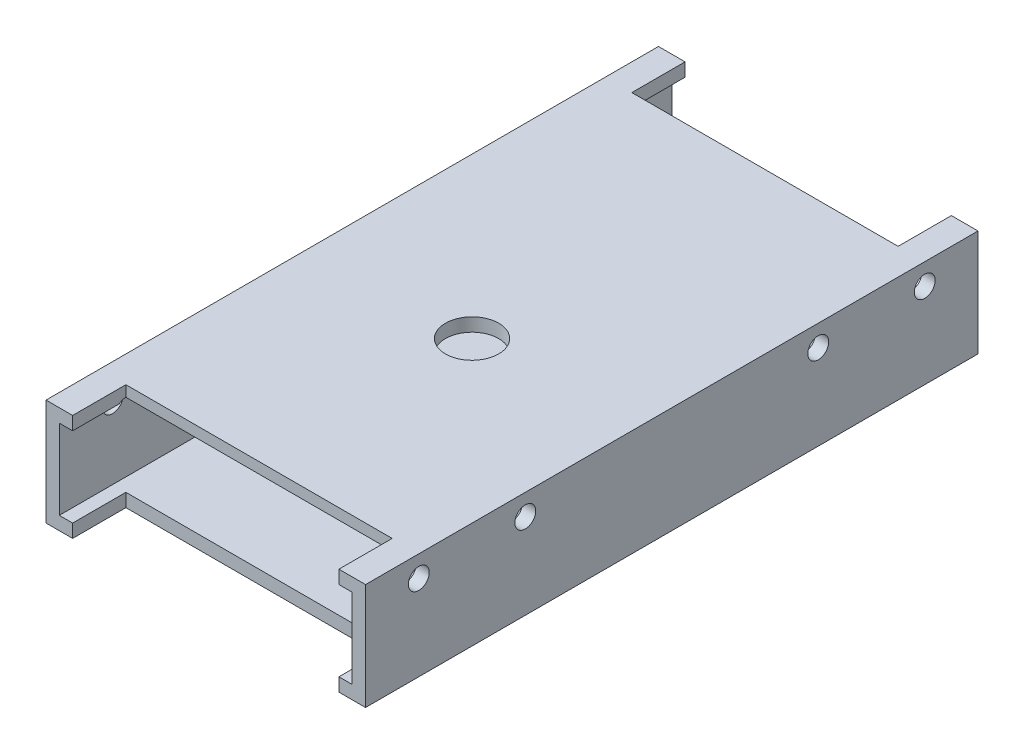
ISO-10303-21;
HEADER;
FILE_DESCRIPTION(('STEP AP214'),'2;1');
FILE_NAME('part.step','',(''),(''),'','','');
FILE_SCHEMA(('AUTOMOTIVE_DESIGN { 1 0 10303 214 1 1 1 1 }'));
ENDSEC;
DATA;
#1=APPLICATION_CONTEXT('core data for automotive mechanical design processes');
#2=APPLICATION_PROTOCOL_DEFINITION('international standard','automotive_design',2000,#1);
#3=PRODUCT_CONTEXT('',#1,'mechanical');
#4=PRODUCT('Part','Part','',(#3));
#5=PRODUCT_RELATED_PRODUCT_CATEGORY('part','',(#4));
#6=PRODUCT_DEFINITION_FORMATION('','',#4);
#7=PRODUCT_DEFINITION_CONTEXT('part definition',#1,'design');
#8=PRODUCT_DEFINITION('design','',#6,#7);
#9=PRODUCT_DEFINITION_SHAPE('','',#8);
#10=(LENGTH_UNIT() NAMED_UNIT(*) SI_UNIT(.MILLI.,.METRE.));
#11=(NAMED_UNIT(*) PLANE_ANGLE_UNIT() SI_UNIT($,.RADIAN.));
#12=(NAMED_UNIT(*) SI_UNIT($,.STERADIAN.) SOLID_ANGLE_UNIT());
#13=UNCERTAINTY_MEASURE_WITH_UNIT(LENGTH_MEASURE(1.E-05),#10,'distance_accuracy_value','');
#14=(GEOMETRIC_REPRESENTATION_CONTEXT(3) GLOBAL_UNCERTAINTY_ASSIGNED_CONTEXT((#13)) GLOBAL_UNIT_ASSIGNED_CONTEXT((#10,
#11,#12)) REPRESENTATION_CONTEXT('',''));
#15=CARTESIAN_POINT('',(0.,0.,0.));
#16=DIRECTION('',(0.,0.,1.));
#17=DIRECTION('',(1.,0.,0.));
#18=AXIS2_PLACEMENT_3D('',#15,#16,#17);
#19=CARTESIAN_POINT('',(0.,9.525,73.025));
#20=DIRECTION('',(0.,-1.,0.));
#21=DIRECTION('',(0.,0.,-1.));
#22=AXIS2_PLACEMENT_3D('',#19,#20,#21);
#23=PLANE('',#22);
#24=DIRECTION('',(1.,0.,0.));
#25=VECTOR('',#24,1.);
#26=CARTESIAN_POINT('',(-38.1,9.525,58.7227853951483));
#27=LINE('',#26,#25);
#28=CARTESIAN_POINT('',(-34.925,9.525,58.7227853951483));
#29=VERTEX_POINT('',#28);
#30=CARTESIAN_POINT('',(34.925,9.525,58.7227853951483));
#31=VERTEX_POINT('',#30);
#32=EDGE_CURVE('E657',#29,#31,#27,.T.);
#33=ORIENTED_EDGE('',*,*,#32,.F.);
#34=DIRECTION('',(0.,0.,-1.));
#35=VECTOR('',#34,1.);
#36=CARTESIAN_POINT('',(-34.925,9.525,73.025));
#37=LINE('',#36,#35);
#38=CARTESIAN_POINT('',(-34.925,9.525,36.5272146048516));
#39=VERTEX_POINT('',#38);
#40=EDGE_CURVE('E428',#29,#39,#37,.T.);
#41=ORIENTED_EDGE('',*,*,#40,.T.);
#42=DIRECTION('',(1.,0.,0.));
#43=VECTOR('',#42,1.);
#44=CARTESIAN_POINT('',(-38.1,9.525,36.5272146048516));
#45=LINE('',#44,#43);
#46=CARTESIAN_POINT('',(34.925,9.525,36.5272146048516));
#47=VERTEX_POINT('',#46);
#48=EDGE_CURVE('E85',#47,#39,#45,.F.);
#49=ORIENTED_EDGE('',*,*,#48,.F.);
#50=DIRECTION('',(0.,0.,-1.));
#51=VECTOR('',#50,1.);
#52=CARTESIAN_POINT('',(34.925,9.525,73.025));
#53=LINE('',#52,#51);
#54=EDGE_CURVE('E434',#31,#47,#53,.T.);
#55=ORIENTED_EDGE('',*,*,#54,.F.);
#56=EDGE_LOOP('',(#33,#41,#49,#55));
#57=FACE_BOUND('',#56,.T.);
#58=ADVANCED_FACE('F61',(#57),#23,.T.);
#59=DIRECTION('',(1.,0.,0.));
#60=VECTOR('',#59,1.);
#61=CARTESIAN_POINT('',(-38.1,9.525,61.9272146048516));
#62=LINE('',#61,#60);
#63=CARTESIAN_POINT('',(34.925,9.525,61.9272146048516));
#64=VERTEX_POINT('',#63);
#65=CARTESIAN_POINT('',(31.75,9.525,61.9272146048516));
#66=VERTEX_POINT('',#65);
#67=EDGE_CURVE('E667',#64,#66,#62,.F.);
#68=ORIENTED_EDGE('',*,*,#67,.F.);
#69=CARTESIAN_POINT('',(34.925,9.525,73.025));
#70=VERTEX_POINT('',#69);
#71=EDGE_CURVE('E429',#70,#64,#53,.T.);
#72=ORIENTED_EDGE('',*,*,#71,.F.);
#73=DIRECTION('',(-1.,0.,0.));
#74=VECTOR('',#73,1.);
#75=CARTESIAN_POINT('',(0.,9.525,73.025));
#76=LINE('',#75,#74);
#77=CARTESIAN_POINT('',(31.75,9.525,73.025));
#78=VERTEX_POINT('',#77);
#79=EDGE_CURVE('E386',#70,#78,#76,.T.);
#80=ORIENTED_EDGE('',*,*,#79,.T.);
#81=DIRECTION('',(0.,0.,-1.));
#82=VECTOR('',#81,1.);
#83=CARTESIAN_POINT('',(31.75,9.525,73.025));
#84=LINE('',#83,#82);
#85=EDGE_CURVE('E366',#78,#66,#84,.T.);
#86=ORIENTED_EDGE('',*,*,#85,.T.);
#87=EDGE_LOOP('',(#68,#72,#80,#86));
#88=FACE_BOUND('',#87,.T.);
#89=ADVANCED_FACE('F739',(#88),#23,.T.);
#90=DIRECTION('',(1.,0.,0.));
#91=VECTOR('',#90,1.);
#92=CARTESIAN_POINT('',(-38.1,9.525,-36.5272146048516));
#93=LINE('',#92,#91);
#94=CARTESIAN_POINT('',(-34.925,9.525,-36.5272146048516));
#95=VERTEX_POINT('',#94);
#96=CARTESIAN_POINT('',(34.925,9.525,-36.5272146048516));
#97=VERTEX_POINT('',#96);
#98=EDGE_CURVE('E637',#95,#97,#93,.T.);
#99=ORIENTED_EDGE('',*,*,#98,.F.);
#100=CARTESIAN_POINT('',(-34.925,9.525,-58.7227853951483));
#101=VERTEX_POINT('',#100);
#102=EDGE_CURVE('E530',#95,#101,#37,.T.);
#103=ORIENTED_EDGE('',*,*,#102,.T.);
#104=DIRECTION('',(1.,0.,0.));
#105=VECTOR('',#104,1.);
#106=CARTESIAN_POINT('',(-38.1,9.525,-58.7227853951483));
#107=LINE('',#106,#105);
#108=CARTESIAN_POINT('',(34.925,9.525,-58.7227853951483));
#109=VERTEX_POINT('',#108);
#110=EDGE_CURVE('E680',#109,#101,#107,.F.);
#111=ORIENTED_EDGE('',*,*,#110,.F.);
#112=EDGE_CURVE('E579',#97,#109,#53,.T.);
#113=ORIENTED_EDGE('',*,*,#112,.F.);
#114=EDGE_LOOP('',(#99,#103,#111,#113));
#115=FACE_BOUND('',#114,.T.);
#116=ADVANCED_FACE('F744',(#115),#23,.T.);
#117=DIRECTION('',(1.,0.,0.));
#118=VECTOR('',#117,1.);
#119=CARTESIAN_POINT('',(-38.1,9.525,-61.9272146048516));
#120=LINE('',#119,#118);
#121=CARTESIAN_POINT('',(-34.925,9.525,-61.9272146048516));
#122=VERTEX_POINT('',#121);
#123=CARTESIAN_POINT('',(-31.75,9.525,-61.9272146048516));
#124=VERTEX_POINT('',#123);
#125=EDGE_CURVE('E289',#122,#124,#120,.T.);
#126=ORIENTED_EDGE('',*,*,#125,.F.);
#127=CARTESIAN_POINT('',(-34.925,9.525,-73.025));
#128=VERTEX_POINT('',#127);
#129=EDGE_CURVE('E422',#122,#128,#37,.T.);
#130=ORIENTED_EDGE('',*,*,#129,.T.);
#131=DIRECTION('',(-1.,0.,0.));
#132=VECTOR('',#131,1.);
#133=CARTESIAN_POINT('',(0.,9.525,-73.025));
#134=LINE('',#133,#132);
#135=CARTESIAN_POINT('',(-31.75,9.525,-73.025));
#136=VERTEX_POINT('',#135);
#137=EDGE_CURVE('E403',#136,#128,#134,.T.);
#138=ORIENTED_EDGE('',*,*,#137,.F.);
#139=DIRECTION('',(0.,0.,-1.));
#140=VECTOR('',#139,1.);
#141=CARTESIAN_POINT('',(-31.75,9.525,73.025));
#142=LINE('',#141,#140);
#143=EDGE_CURVE('E373',#124,#136,#142,.T.);
#144=ORIENTED_EDGE('',*,*,#143,.F.);
#145=EDGE_LOOP('',(#126,#130,#138,#144));
#146=FACE_BOUND('',#145,.T.);
#147=ADVANCED_FACE('F542',(#146),#23,.T.);
#148=CARTESIAN_POINT('',(31.75,9.525,-61.9272146048516));
#149=VERTEX_POINT('',#148);
#150=CARTESIAN_POINT('',(34.925,9.525,-61.9272146048516));
#151=VERTEX_POINT('',#150);
#152=EDGE_CURVE('E679',#149,#151,#120,.T.);
#153=ORIENTED_EDGE('',*,*,#152,.F.);
#154=DIRECTION('',(0.,0.,1.));
#155=VECTOR('',#154,1.);
#156=CARTESIAN_POINT('',(31.75,9.525,73.025));
#157=LINE('',#156,#155);
#158=CARTESIAN_POINT('',(31.75,9.525,-73.025));
#159=VERTEX_POINT('',#158);
#160=EDGE_CURVE('E376',#159,#149,#157,.T.);
#161=ORIENTED_EDGE('',*,*,#160,.F.);
#162=CARTESIAN_POINT('',(34.925,9.525,-73.025));
#163=VERTEX_POINT('',#162);
#164=EDGE_CURVE('E404',#163,#159,#134,.T.);
#165=ORIENTED_EDGE('',*,*,#164,.F.);
#166=EDGE_CURVE('E427',#151,#163,#53,.T.);
#167=ORIENTED_EDGE('',*,*,#166,.F.);
#168=EDGE_LOOP('',(#153,#161,#165,#167));
#169=FACE_BOUND('',#168,.T.);
#170=ADVANCED_FACE('F594',(#169),#23,.T.);
#171=CARTESIAN_POINT('',(0.,9.525,9.52499999999999));
#172=DIRECTION('',(0.,-1.,0.));
#173=DIRECTION('',(0.,0.,-1.));
#174=AXIS2_PLACEMENT_3D('',#171,#172,#173);
#175=CIRCLE('',#174,6.35);
#176=CARTESIAN_POINT('',(0.,9.525,3.17499999999999));
#177=VERTEX_POINT('',#176);
#178=EDGE_CURVE('E700',#177,#177,#175,.T.);
#179=ORIENTED_EDGE('',*,*,#178,.F.);
#180=EDGE_LOOP('',(#179));
#181=FACE_BOUND('',#180,.T.);
#182=DIRECTION('',(1.,0.,0.));
#183=VECTOR('',#182,1.);
#184=CARTESIAN_POINT('',(-38.1,9.525,-33.3227853951483));
#185=LINE('',#184,#183);
#186=CARTESIAN_POINT('',(34.925,9.525,-33.3227853951483));
#187=VERTEX_POINT('',#186);
#188=CARTESIAN_POINT('',(-34.925,9.525,-33.3227853951483));
#189=VERTEX_POINT('',#188);
#190=EDGE_CURVE('E77',#187,#189,#185,.F.);
#191=ORIENTED_EDGE('',*,*,#190,.F.);
#192=CARTESIAN_POINT('',(34.925,9.525,33.3227853951483));
#193=VERTEX_POINT('',#192);
#194=EDGE_CURVE('E522',#193,#187,#53,.T.);
#195=ORIENTED_EDGE('',*,*,#194,.F.);
#196=DIRECTION('',(1.,0.,0.));
#197=VECTOR('',#196,1.);
#198=CARTESIAN_POINT('',(-38.1,9.525,33.3227853951483));
#199=LINE('',#198,#197);
#200=CARTESIAN_POINT('',(-34.925,9.525,33.3227853951483));
#201=VERTEX_POINT('',#200);
#202=EDGE_CURVE('E510',#201,#193,#199,.T.);
#203=ORIENTED_EDGE('',*,*,#202,.F.);
#204=EDGE_CURVE('E520',#201,#189,#37,.T.);
#205=ORIENTED_EDGE('',*,*,#204,.T.);
#206=EDGE_LOOP('',(#191,#195,#203,#205));
#207=FACE_BOUND('',#206,.T.);
#208=ADVANCED_FACE('F519',(#181,#207),#23,.T.);
#209=CARTESIAN_POINT('',(0.,0.,73.025));
#210=DIRECTION('',(0.,0.,1.));
#211=DIRECTION('',(1.,0.,0.));
#212=AXIS2_PLACEMENT_3D('',#209,#210,#211);
#213=PLANE('',#212);
#214=DIRECTION('',(1.,0.,0.));
#215=VECTOR('',#214,1.);
#216=CARTESIAN_POINT('',(-38.1,-12.7,73.025));
#217=LINE('',#216,#215);
#218=CARTESIAN_POINT('',(-38.1,-12.7,73.025));
#219=VERTEX_POINT('',#218);
#220=CARTESIAN_POINT('',(-31.75,-12.7,73.025));
#221=VERTEX_POINT('',#220);
#222=EDGE_CURVE('E449',#219,#221,#217,.T.);
#223=ORIENTED_EDGE('',*,*,#222,.T.);
#224=DIRECTION('',(0.,-1.,0.));
#225=VECTOR('',#224,1.);
#226=CARTESIAN_POINT('',(-31.75,12.7,73.025));
#227=LINE('',#226,#225);
#228=CARTESIAN_POINT('',(-31.75,-9.525,73.025));
#229=VERTEX_POINT('',#228);
#230=EDGE_CURVE('E356',#229,#221,#227,.T.);
#231=ORIENTED_EDGE('',*,*,#230,.F.);
#232=DIRECTION('',(1.,0.,0.));
#233=VECTOR('',#232,1.);
#234=CARTESIAN_POINT('',(0.,-9.525,73.025));
#235=LINE('',#234,#233);
#236=CARTESIAN_POINT('',(-34.925,-9.525,73.025));
#237=VERTEX_POINT('',#236);
#238=EDGE_CURVE('E395',#237,#229,#235,.T.);
#239=ORIENTED_EDGE('',*,*,#238,.F.);
#240=DIRECTION('',(0.,-1.,0.));
#241=VECTOR('',#240,1.);
#242=CARTESIAN_POINT('',(-34.925,0.,73.025));
#243=LINE('',#242,#241);
#244=CARTESIAN_POINT('',(-34.925,9.525,73.025));
#245=VERTEX_POINT('',#244);
#246=EDGE_CURVE('E390',#245,#237,#243,.T.);
#247=ORIENTED_EDGE('',*,*,#246,.F.);
#248=CARTESIAN_POINT('',(-31.75,9.525,73.025));
#249=VERTEX_POINT('',#248);
#250=EDGE_CURVE('E384',#249,#245,#76,.T.);
#251=ORIENTED_EDGE('',*,*,#250,.F.);
#252=CARTESIAN_POINT('',(-31.75,12.7,73.025));
#253=VERTEX_POINT('',#252);
#254=EDGE_CURVE('E352',#253,#249,#227,.T.);
#255=ORIENTED_EDGE('',*,*,#254,.F.);
#256=DIRECTION('',(-1.,0.,0.));
#257=VECTOR('',#256,1.);
#258=CARTESIAN_POINT('',(-38.1,12.7,73.025));
#259=LINE('',#258,#257);
#260=CARTESIAN_POINT('',(-38.1,12.7,73.025));
#261=VERTEX_POINT('',#260);
#262=EDGE_CURVE('E439',#253,#261,#259,.T.);
#263=ORIENTED_EDGE('',*,*,#262,.T.);
#264=DIRECTION('',(0.,-1.,0.));
#265=VECTOR('',#264,1.);
#266=CARTESIAN_POINT('',(-38.1,-12.7,73.025));
#267=LINE('',#266,#265);
#268=EDGE_CURVE('E445',#261,#219,#267,.T.);
#269=ORIENTED_EDGE('',*,*,#268,.T.);
#270=EDGE_LOOP('',(#223,#231,#239,#247,#251,#255,#263,#269));
#271=FACE_BOUND('',#270,.T.);
#272=ADVANCED_FACE('F750',(#271),#213,.T.);
#273=CARTESIAN_POINT('',(38.1,12.7,73.025));
#274=VERTEX_POINT('',#273);
#275=CARTESIAN_POINT('',(31.75,12.7,73.025));
#276=VERTEX_POINT('',#275);
#277=EDGE_CURVE('E441',#274,#276,#259,.T.);
#278=ORIENTED_EDGE('',*,*,#277,.T.);
#279=DIRECTION('',(0.,-1.,0.));
#280=VECTOR('',#279,1.);
#281=CARTESIAN_POINT('',(31.75,12.7,73.025));
#282=LINE('',#281,#280);
#283=EDGE_CURVE('E357',#276,#78,#282,.T.);
#284=ORIENTED_EDGE('',*,*,#283,.T.);
#285=ORIENTED_EDGE('',*,*,#79,.F.);
#286=DIRECTION('',(0.,1.,0.));
#287=VECTOR('',#286,1.);
#288=CARTESIAN_POINT('',(34.925,0.,73.025));
#289=LINE('',#288,#287);
#290=CARTESIAN_POINT('',(34.925,-9.525,73.025));
#291=VERTEX_POINT('',#290);
#292=EDGE_CURVE('E381',#291,#70,#289,.T.);
#293=ORIENTED_EDGE('',*,*,#292,.F.);
#294=CARTESIAN_POINT('',(31.75,-9.525,73.025));
#295=VERTEX_POINT('',#294);
#296=EDGE_CURVE('E394',#295,#291,#235,.T.);
#297=ORIENTED_EDGE('',*,*,#296,.F.);
#298=CARTESIAN_POINT('',(31.75,-12.7,73.025));
#299=VERTEX_POINT('',#298);
#300=EDGE_CURVE('E361',#295,#299,#282,.T.);
#301=ORIENTED_EDGE('',*,*,#300,.T.);
#302=CARTESIAN_POINT('',(38.1,-12.7,73.025));
#303=VERTEX_POINT('',#302);
#304=EDGE_CURVE('E448',#299,#303,#217,.T.);
#305=ORIENTED_EDGE('',*,*,#304,.T.);
#306=DIRECTION('',(0.,1.,0.));
#307=VECTOR('',#306,1.);
#308=CARTESIAN_POINT('',(38.1,-12.7,73.025));
#309=LINE('',#308,#307);
#310=EDGE_CURVE('E435',#303,#274,#309,.T.);
#311=ORIENTED_EDGE('',*,*,#310,.T.);
#312=EDGE_LOOP('',(#278,#284,#285,#293,#297,#301,#305,#311));
#313=FACE_BOUND('',#312,.T.);
#314=ADVANCED_FACE('F752',(#313),#213,.T.);
#315=CARTESIAN_POINT('',(0.,0.,-73.025));
#316=DIRECTION('',(0.,0.,1.));
#317=DIRECTION('',(1.,0.,0.));
#318=AXIS2_PLACEMENT_3D('',#315,#316,#317);
#319=PLANE('',#318);
#320=DIRECTION('',(1.,0.,0.));
#321=VECTOR('',#320,1.);
#322=CARTESIAN_POINT('',(-38.1,-12.7,-73.025));
#323=LINE('',#322,#321);
#324=CARTESIAN_POINT('',(31.75,-12.7,-73.025));
#325=VERTEX_POINT('',#324);
#326=CARTESIAN_POINT('',(38.1,-12.7,-73.025));
#327=VERTEX_POINT('',#326);
#328=EDGE_CURVE('E465',#325,#327,#323,.T.);
#329=ORIENTED_EDGE('',*,*,#328,.F.);
#330=DIRECTION('',(0.,-1.,0.));
#331=VECTOR('',#330,1.);
#332=CARTESIAN_POINT('',(31.75,12.7,-73.025));
#333=LINE('',#332,#331);
#334=CARTESIAN_POINT('',(31.75,-9.525,-73.025));
#335=VERTEX_POINT('',#334);
#336=EDGE_CURVE('E601',#335,#325,#333,.T.);
#337=ORIENTED_EDGE('',*,*,#336,.F.);
#338=DIRECTION('',(1.,0.,0.));
#339=VECTOR('',#338,1.);
#340=CARTESIAN_POINT('',(0.,-9.525,-73.025));
#341=LINE('',#340,#339);
#342=CARTESIAN_POINT('',(34.925,-9.525,-73.025));
#343=VERTEX_POINT('',#342);
#344=EDGE_CURVE('E412',#335,#343,#341,.T.);
#345=ORIENTED_EDGE('',*,*,#344,.T.);
#346=DIRECTION('',(0.,1.,0.));
#347=VECTOR('',#346,1.);
#348=CARTESIAN_POINT('',(34.925,0.,-73.025));
#349=LINE('',#348,#347);
#350=EDGE_CURVE('E380',#343,#163,#349,.T.);
#351=ORIENTED_EDGE('',*,*,#350,.T.);
#352=ORIENTED_EDGE('',*,*,#164,.T.);
#353=CARTESIAN_POINT('',(31.75,12.7,-73.025));
#354=VERTEX_POINT('',#353);
#355=EDGE_CURVE('E608',#354,#159,#333,.T.);
#356=ORIENTED_EDGE('',*,*,#355,.F.);
#357=DIRECTION('',(-1.,0.,0.));
#358=VECTOR('',#357,1.);
#359=CARTESIAN_POINT('',(-38.1,12.7,-73.025));
#360=LINE('',#359,#358);
#361=CARTESIAN_POINT('',(38.1,12.7,-73.025));
#362=VERTEX_POINT('',#361);
#363=EDGE_CURVE('E458',#362,#354,#360,.T.);
#364=ORIENTED_EDGE('',*,*,#363,.F.);
#365=DIRECTION('',(0.,1.,0.));
#366=VECTOR('',#365,1.);
#367=CARTESIAN_POINT('',(38.1,-12.7,-73.025));
#368=LINE('',#367,#366);
#369=EDGE_CURVE('E433',#327,#362,#368,.T.);
#370=ORIENTED_EDGE('',*,*,#369,.F.);
#371=EDGE_LOOP('',(#329,#337,#345,#351,#352,#356,#364,#370));
#372=FACE_BOUND('',#371,.T.);
#373=ADVANCED_FACE('F598',(#372),#319,.F.);
#374=CARTESIAN_POINT('',(-38.1,12.7,73.025));
#375=DIRECTION('',(0.,-1.,0.));
#376=DIRECTION('',(0.,0.,-1.));
#377=AXIS2_PLACEMENT_3D('',#374,#375,#376);
#378=PLANE('',#377);
#379=CARTESIAN_POINT('',(0.,12.7,9.52499999999999));
#380=DIRECTION('',(0.,-1.,0.));
#381=DIRECTION('',(0.,0.,-1.));
#382=AXIS2_PLACEMENT_3D('',#379,#380,#381);
#383=CIRCLE('',#382,6.35);
#384=CARTESIAN_POINT('',(0.,12.7,3.17499999999999));
#385=VERTEX_POINT('',#384);
#386=EDGE_CURVE('E714',#385,#385,#383,.T.);
#387=ORIENTED_EDGE('',*,*,#386,.T.);
#388=EDGE_LOOP('',(#387));
#389=FACE_BOUND('',#388,.T.);
#390=ORIENTED_EDGE('',*,*,#363,.T.);
#391=DIRECTION('',(0.,0.,1.));
#392=VECTOR('',#391,1.);
#393=CARTESIAN_POINT('',(31.75,12.7,0.));
#394=LINE('',#393,#392);
#395=CARTESIAN_POINT('',(31.75,12.7,-60.325));
#396=VERTEX_POINT('',#395);
#397=EDGE_CURVE('E320',#354,#396,#394,.T.);
#398=ORIENTED_EDGE('',*,*,#397,.T.);
#399=DIRECTION('',(-1.,0.,0.));
#400=VECTOR('',#399,1.);
#401=CARTESIAN_POINT('',(0.,12.7,-60.325));
#402=LINE('',#401,#400);
#403=CARTESIAN_POINT('',(-31.75,12.7,-60.325));
#404=VERTEX_POINT('',#403);
#405=EDGE_CURVE('E618',#396,#404,#402,.T.);
#406=ORIENTED_EDGE('',*,*,#405,.T.);
#407=DIRECTION('',(0.,0.,-1.));
#408=VECTOR('',#407,1.);
#409=CARTESIAN_POINT('',(-31.75,12.7,0.));
#410=LINE('',#409,#408);
#411=CARTESIAN_POINT('',(-31.75,12.7,-73.025));
#412=VERTEX_POINT('',#411);
#413=EDGE_CURVE('E309',#404,#412,#410,.T.);
#414=ORIENTED_EDGE('',*,*,#413,.T.);
#415=CARTESIAN_POINT('',(-38.1,12.7,-73.025));
#416=VERTEX_POINT('',#415);
#417=EDGE_CURVE('E457',#412,#416,#360,.T.);
#418=ORIENTED_EDGE('',*,*,#417,.T.);
#419=DIRECTION('',(0.,0.,-1.));
#420=VECTOR('',#419,1.);
#421=CARTESIAN_POINT('',(-38.1,12.7,73.025));
#422=LINE('',#421,#420);
#423=EDGE_CURVE('E476',#261,#416,#422,.T.);
#424=ORIENTED_EDGE('',*,*,#423,.F.);
#425=ORIENTED_EDGE('',*,*,#262,.F.);
#426=DIRECTION('',(0.,0.,1.));
#427=VECTOR('',#426,1.);
#428=CARTESIAN_POINT('',(-31.75,12.7,0.));
#429=LINE('',#428,#427);
#430=CARTESIAN_POINT('',(-31.75,12.7,60.325));
#431=VERTEX_POINT('',#430);
#432=EDGE_CURVE('E330',#431,#253,#429,.T.);
#433=ORIENTED_EDGE('',*,*,#432,.F.);
#434=DIRECTION('',(-1.,0.,0.));
#435=VECTOR('',#434,1.);
#436=CARTESIAN_POINT('',(0.,12.7,60.325));
#437=LINE('',#436,#435);
#438=CARTESIAN_POINT('',(31.75,12.7,60.325));
#439=VERTEX_POINT('',#438);
#440=EDGE_CURVE('E323',#439,#431,#437,.T.);
#441=ORIENTED_EDGE('',*,*,#440,.F.);
#442=DIRECTION('',(0.,0.,-1.));
#443=VECTOR('',#442,1.);
#444=CARTESIAN_POINT('',(31.75,12.7,0.));
#445=LINE('',#444,#443);
#446=EDGE_CURVE('E326',#276,#439,#445,.T.);
#447=ORIENTED_EDGE('',*,*,#446,.F.);
#448=ORIENTED_EDGE('',*,*,#277,.F.);
#449=DIRECTION('',(0.,0.,-1.));
#450=VECTOR('',#449,1.);
#451=CARTESIAN_POINT('',(38.1,12.7,73.025));
#452=LINE('',#451,#450);
#453=EDGE_CURVE('E480',#274,#362,#452,.T.);
#454=ORIENTED_EDGE('',*,*,#453,.T.);
#455=EDGE_LOOP('',(#390,#398,#406,#414,#418,#424,#425,#433,#441,#447,#448,#454));
#456=FACE_BOUND('',#455,.T.);
#457=ADVANCED_FACE('F757',(#389,#456),#378,.F.);
#458=CARTESIAN_POINT('',(-38.1,-12.7,73.025));
#459=DIRECTION('',(0.,1.,0.));
#460=DIRECTION('',(0.,0.,1.));
#461=AXIS2_PLACEMENT_3D('',#458,#459,#460);
#462=PLANE('',#461);
#463=CARTESIAN_POINT('',(0.,-12.7,9.52499999999999));
#464=DIRECTION('',(0.,-1.,0.));
#465=DIRECTION('',(0.,0.,-1.));
#466=AXIS2_PLACEMENT_3D('',#463,#464,#465);
#467=CIRCLE('',#466,6.35);
#468=CARTESIAN_POINT('',(0.,-12.7,3.17499999999999));
#469=VERTEX_POINT('',#468);
#470=EDGE_CURVE('E710',#469,#469,#467,.T.);
#471=ORIENTED_EDGE('',*,*,#470,.F.);
#472=EDGE_LOOP('',(#471));
#473=FACE_BOUND('',#472,.T.);
#474=DIRECTION('',(-1.,0.,0.));
#475=VECTOR('',#474,1.);
#476=CARTESIAN_POINT('',(0.,-12.7,-60.325));
#477=LINE('',#476,#475);
#478=CARTESIAN_POINT('',(31.75,-12.7,-60.325));
#479=VERTEX_POINT('',#478);
#480=CARTESIAN_POINT('',(-31.75,-12.7,-60.325));
#481=VERTEX_POINT('',#480);
#482=EDGE_CURVE('E350',#479,#481,#477,.T.);
#483=ORIENTED_EDGE('',*,*,#482,.F.);
#484=DIRECTION('',(0.,0.,1.));
#485=VECTOR('',#484,1.);
#486=CARTESIAN_POINT('',(31.75,-12.7,0.));
#487=LINE('',#486,#485);
#488=EDGE_CURVE('E615',#325,#479,#487,.T.);
#489=ORIENTED_EDGE('',*,*,#488,.F.);
#490=ORIENTED_EDGE('',*,*,#328,.T.);
#491=DIRECTION('',(0.,0.,-1.));
#492=VECTOR('',#491,1.);
#493=CARTESIAN_POINT('',(38.1,-12.7,73.025));
#494=LINE('',#493,#492);
#495=EDGE_CURVE('E453',#303,#327,#494,.T.);
#496=ORIENTED_EDGE('',*,*,#495,.F.);
#497=ORIENTED_EDGE('',*,*,#304,.F.);
#498=DIRECTION('',(0.,0.,-1.));
#499=VECTOR('',#498,1.);
#500=CARTESIAN_POINT('',(31.75,-12.7,0.));
#501=LINE('',#500,#499);
#502=CARTESIAN_POINT('',(31.75,-12.7,60.325));
#503=VERTEX_POINT('',#502);
#504=EDGE_CURVE('E338',#299,#503,#501,.T.);
#505=ORIENTED_EDGE('',*,*,#504,.T.);
#506=DIRECTION('',(-1.,0.,0.));
#507=VECTOR('',#506,1.);
#508=CARTESIAN_POINT('',(0.,-12.7,60.325));
#509=LINE('',#508,#507);
#510=CARTESIAN_POINT('',(-31.75,-12.7,60.325));
#511=VERTEX_POINT('',#510);
#512=EDGE_CURVE('E334',#503,#511,#509,.T.);
#513=ORIENTED_EDGE('',*,*,#512,.T.);
#514=DIRECTION('',(0.,0.,1.));
#515=VECTOR('',#514,1.);
#516=CARTESIAN_POINT('',(-31.75,-12.7,0.));
#517=LINE('',#516,#515);
#518=EDGE_CURVE('E327',#511,#221,#517,.T.);
#519=ORIENTED_EDGE('',*,*,#518,.T.);
#520=ORIENTED_EDGE('',*,*,#222,.F.);
#521=DIRECTION('',(0.,0.,-1.));
#522=VECTOR('',#521,1.);
#523=CARTESIAN_POINT('',(-38.1,-12.7,73.025));
#524=LINE('',#523,#522);
#525=CARTESIAN_POINT('',(-38.1,-12.7,-73.025));
#526=VERTEX_POINT('',#525);
#527=EDGE_CURVE('E472',#219,#526,#524,.T.);
#528=ORIENTED_EDGE('',*,*,#527,.T.);
#529=CARTESIAN_POINT('',(-31.75,-12.7,-73.025));
#530=VERTEX_POINT('',#529);
#531=EDGE_CURVE('E440',#526,#530,#323,.T.);
#532=ORIENTED_EDGE('',*,*,#531,.T.);
#533=DIRECTION('',(0.,0.,-1.));
#534=VECTOR('',#533,1.);
#535=CARTESIAN_POINT('',(-31.75,-12.7,0.));
#536=LINE('',#535,#534);
#537=EDGE_CURVE('E566',#481,#530,#536,.T.);
#538=ORIENTED_EDGE('',*,*,#537,.F.);
#539=EDGE_LOOP('',(#483,#489,#490,#496,#497,#505,#513,#519,#520,#528,#532,#538));
#540=FACE_BOUND('',#539,.T.);
#541=ADVANCED_FACE('F565',(#473,#540),#462,.F.);
#542=CARTESIAN_POINT('',(-31.75,9.525,61.9272146048516));
#543=VERTEX_POINT('',#542);
#544=CARTESIAN_POINT('',(-34.925,9.525,61.9272146048516));
#545=VERTEX_POINT('',#544);
#546=EDGE_CURVE('E660',#543,#545,#62,.F.);
#547=ORIENTED_EDGE('',*,*,#546,.F.);
#548=DIRECTION('',(0.,0.,1.));
#549=VECTOR('',#548,1.);
#550=CARTESIAN_POINT('',(-31.75,9.525,73.025));
#551=LINE('',#550,#549);
#552=EDGE_CURVE('E370',#543,#249,#551,.T.);
#553=ORIENTED_EDGE('',*,*,#552,.T.);
#554=ORIENTED_EDGE('',*,*,#250,.T.);
#555=EDGE_CURVE('E423',#245,#545,#37,.T.);
#556=ORIENTED_EDGE('',*,*,#555,.T.);
#557=EDGE_LOOP('',(#547,#553,#554,#556));
#558=FACE_BOUND('',#557,.T.);
#559=ADVANCED_FACE('F727',(#558),#23,.T.);
#560=CARTESIAN_POINT('',(0.,-9.525,73.025));
#561=DIRECTION('',(0.,1.,0.));
#562=DIRECTION('',(0.,0.,1.));
#563=AXIS2_PLACEMENT_3D('',#560,#561,#562);
#564=PLANE('',#563);
#565=CARTESIAN_POINT('',(0.,-9.525,9.52499999999999));
#566=DIRECTION('',(0.,1.,0.));
#567=DIRECTION('',(0.,0.,1.));
#568=AXIS2_PLACEMENT_3D('',#565,#566,#567);
#569=CIRCLE('',#568,6.35);
#570=CARTESIAN_POINT('',(0.,-9.525,15.875));
#571=VERTEX_POINT('',#570);
#572=EDGE_CURVE('E65',#571,#571,#569,.T.);
#573=ORIENTED_EDGE('',*,*,#572,.F.);
#574=EDGE_LOOP('',(#573));
#575=FACE_BOUND('',#574,.T.);
#576=DIRECTION('',(0.,0.,-1.));
#577=VECTOR('',#576,1.);
#578=CARTESIAN_POINT('',(31.75,-9.525,73.025));
#579=LINE('',#578,#577);
#580=CARTESIAN_POINT('',(31.75,-9.525,-60.325));
#581=VERTEX_POINT('',#580);
#582=EDGE_CURVE('E295',#581,#335,#579,.T.);
#583=ORIENTED_EDGE('',*,*,#582,.F.);
#584=DIRECTION('',(1.,0.,0.));
#585=VECTOR('',#584,1.);
#586=CARTESIAN_POINT('',(0.,-9.525,-60.325));
#587=LINE('',#586,#585);
#588=CARTESIAN_POINT('',(-31.75,-9.525,-60.325));
#589=VERTEX_POINT('',#588);
#590=EDGE_CURVE('E499',#589,#581,#587,.T.);
#591=ORIENTED_EDGE('',*,*,#590,.F.);
#592=DIRECTION('',(0.,0.,1.));
#593=VECTOR('',#592,1.);
#594=CARTESIAN_POINT('',(-31.75,-9.525,73.025));
#595=LINE('',#594,#593);
#596=CARTESIAN_POINT('',(-31.75,-9.525,-73.025));
#597=VERTEX_POINT('',#596);
#598=EDGE_CURVE('E496',#597,#589,#595,.T.);
#599=ORIENTED_EDGE('',*,*,#598,.F.);
#600=CARTESIAN_POINT('',(-34.925,-9.525,-73.025));
#601=VERTEX_POINT('',#600);
#602=EDGE_CURVE('E385',#601,#597,#341,.T.);
#603=ORIENTED_EDGE('',*,*,#602,.F.);
#604=DIRECTION('',(0.,0.,-1.));
#605=VECTOR('',#604,1.);
#606=CARTESIAN_POINT('',(-34.925,-9.525,73.025));
#607=LINE('',#606,#605);
#608=EDGE_CURVE('E419',#237,#601,#607,.T.);
#609=ORIENTED_EDGE('',*,*,#608,.F.);
#610=ORIENTED_EDGE('',*,*,#238,.T.);
#611=DIRECTION('',(0.,0.,-1.));
#612=VECTOR('',#611,1.);
#613=CARTESIAN_POINT('',(-31.75,-9.525,73.025));
#614=LINE('',#613,#612);
#615=CARTESIAN_POINT('',(-31.75,-9.525,60.325));
#616=VERTEX_POINT('',#615);
#617=EDGE_CURVE('E492',#229,#616,#614,.T.);
#618=ORIENTED_EDGE('',*,*,#617,.T.);
#619=DIRECTION('',(1.,0.,0.));
#620=VECTOR('',#619,1.);
#621=CARTESIAN_POINT('',(0.,-9.525,60.325));
#622=LINE('',#621,#620);
#623=CARTESIAN_POINT('',(31.75,-9.525,60.325));
#624=VERTEX_POINT('',#623);
#625=EDGE_CURVE('E488',#616,#624,#622,.T.);
#626=ORIENTED_EDGE('',*,*,#625,.T.);
#627=DIRECTION('',(0.,0.,1.));
#628=VECTOR('',#627,1.);
#629=CARTESIAN_POINT('',(31.75,-9.525,73.025));
#630=LINE('',#629,#628);
#631=EDGE_CURVE('E484',#624,#295,#630,.T.);
#632=ORIENTED_EDGE('',*,*,#631,.T.);
#633=ORIENTED_EDGE('',*,*,#296,.T.);
#634=DIRECTION('',(0.,0.,-1.));
#635=VECTOR('',#634,1.);
#636=CARTESIAN_POINT('',(34.925,-9.525,73.025));
#637=LINE('',#636,#635);
#638=EDGE_CURVE('E399',#291,#343,#637,.T.);
#639=ORIENTED_EDGE('',*,*,#638,.T.);
#640=ORIENTED_EDGE('',*,*,#344,.F.);
#641=EDGE_LOOP('',(#583,#591,#599,#603,#609,#610,#618,#626,#632,#633,#639,#640));
#642=FACE_BOUND('',#641,.T.);
#643=ADVANCED_FACE('F557',(#575,#642),#564,.T.);
#644=ORIENTED_EDGE('',*,*,#417,.F.);
#645=DIRECTION('',(0.,-1.,0.));
#646=VECTOR('',#645,1.);
#647=CARTESIAN_POINT('',(-31.75,12.7,-73.025));
#648=LINE('',#647,#646);
#649=EDGE_CURVE('E318',#412,#136,#648,.T.);
#650=ORIENTED_EDGE('',*,*,#649,.T.);
#651=ORIENTED_EDGE('',*,*,#137,.T.);
#652=DIRECTION('',(0.,-1.,0.));
#653=VECTOR('',#652,1.);
#654=CARTESIAN_POINT('',(-34.925,0.,-73.025));
#655=LINE('',#654,#653);
#656=EDGE_CURVE('E408',#128,#601,#655,.T.);
#657=ORIENTED_EDGE('',*,*,#656,.T.);
#658=ORIENTED_EDGE('',*,*,#602,.T.);
#659=EDGE_CURVE('E312',#597,#530,#648,.T.);
#660=ORIENTED_EDGE('',*,*,#659,.T.);
#661=ORIENTED_EDGE('',*,*,#531,.F.);
#662=DIRECTION('',(0.,-1.,0.));
#663=VECTOR('',#662,1.);
#664=CARTESIAN_POINT('',(-38.1,-12.7,-73.025));
#665=LINE('',#664,#663);
#666=EDGE_CURVE('E462',#416,#526,#665,.T.);
#667=ORIENTED_EDGE('',*,*,#666,.F.);
#668=EDGE_LOOP('',(#644,#650,#651,#657,#658,#660,#661,#667));
#669=FACE_BOUND('',#668,.T.);
#670=ADVANCED_FACE('F548',(#669),#319,.F.);
#671=CARTESIAN_POINT('',(38.1,-12.7,73.025));
#672=DIRECTION('',(-1.,0.,0.));
#673=DIRECTION('',(0.,0.,1.));
#674=AXIS2_PLACEMENT_3D('',#671,#672,#673);
#675=PLANE('',#674);
#676=CARTESIAN_POINT('',(38.1,7.62,60.325));
#677=DIRECTION('',(-1.,0.,0.));
#678=DIRECTION('',(0.,0.,1.));
#679=AXIS2_PLACEMENT_3D('',#676,#677,#678);
#680=CIRCLE('',#679,2.4892);
#681=CARTESIAN_POINT('',(38.1,7.62,62.8142));
#682=VERTEX_POINT('',#681);
#683=EDGE_CURVE('E650',#682,#682,#680,.T.);
#684=ORIENTED_EDGE('',*,*,#683,.T.);
#685=EDGE_LOOP('',(#684));
#686=FACE_BOUND('',#685,.T.);
#687=CARTESIAN_POINT('',(38.1,7.61999999999999,-34.925));
#688=DIRECTION('',(-1.,0.,0.));
#689=DIRECTION('',(0.,0.,1.));
#690=AXIS2_PLACEMENT_3D('',#687,#688,#689);
#691=CIRCLE('',#690,2.4892);
#692=CARTESIAN_POINT('',(38.1,7.61999999999999,-32.4358));
#693=VERTEX_POINT('',#692);
#694=EDGE_CURVE('E339',#693,#693,#691,.T.);
#695=ORIENTED_EDGE('',*,*,#694,.T.);
#696=EDGE_LOOP('',(#695));
#697=FACE_BOUND('',#696,.T.);
#698=CARTESIAN_POINT('',(38.1,7.62,-60.325));
#699=DIRECTION('',(-1.,0.,0.));
#700=DIRECTION('',(0.,0.,1.));
#701=AXIS2_PLACEMENT_3D('',#698,#699,#700);
#702=CIRCLE('',#701,2.4892);
#703=CARTESIAN_POINT('',(38.1,7.62,-57.8358));
#704=VERTEX_POINT('',#703);
#705=EDGE_CURVE('E673',#704,#704,#702,.T.);
#706=ORIENTED_EDGE('',*,*,#705,.T.);
#707=EDGE_LOOP('',(#706));
#708=FACE_BOUND('',#707,.T.);
#709=CARTESIAN_POINT('',(38.1,7.61999999999999,34.925));
#710=DIRECTION('',(-1.,0.,0.));
#711=DIRECTION('',(0.,0.,1.));
#712=AXIS2_PLACEMENT_3D('',#709,#710,#711);
#713=CIRCLE('',#712,2.4892);
#714=CARTESIAN_POINT('',(38.1,7.61999999999999,37.4142));
#715=VERTEX_POINT('',#714);
#716=EDGE_CURVE('E642',#715,#715,#713,.T.);
#717=ORIENTED_EDGE('',*,*,#716,.T.);
#718=EDGE_LOOP('',(#717));
#719=FACE_BOUND('',#718,.T.);
#720=ORIENTED_EDGE('',*,*,#369,.T.);
#721=ORIENTED_EDGE('',*,*,#453,.F.);
#722=ORIENTED_EDGE('',*,*,#310,.F.);
#723=ORIENTED_EDGE('',*,*,#495,.T.);
#724=EDGE_LOOP('',(#720,#721,#722,#723));
#725=FACE_BOUND('',#724,.T.);
#726=ADVANCED_FACE('F63',(#686,#697,#708,#719,#725),#675,.F.);
#727=CARTESIAN_POINT('',(-38.1,-12.7,73.025));
#728=DIRECTION('',(1.,0.,0.));
#729=DIRECTION('',(0.,0.,-1.));
#730=AXIS2_PLACEMENT_3D('',#727,#728,#729);
#731=PLANE('',#730);
#732=CARTESIAN_POINT('',(-38.1,7.62,60.325));
#733=DIRECTION('',(1.,0.,0.));
#734=DIRECTION('',(0.,0.,1.));
#735=AXIS2_PLACEMENT_3D('',#732,#733,#734);
#736=CIRCLE('',#735,2.4892);
#737=CARTESIAN_POINT('',(-38.1,7.62,62.8142));
#738=VERTEX_POINT('',#737);
#739=EDGE_CURVE('E695',#738,#738,#736,.T.);
#740=ORIENTED_EDGE('',*,*,#739,.T.);
#741=EDGE_LOOP('',(#740));
#742=FACE_BOUND('',#741,.T.);
#743=CARTESIAN_POINT('',(-38.1,7.61999999999999,-34.925));
#744=DIRECTION('',(1.,0.,0.));
#745=DIRECTION('',(0.,0.,-1.));
#746=AXIS2_PLACEMENT_3D('',#743,#744,#745);
#747=CIRCLE('',#746,2.4892);
#748=CARTESIAN_POINT('',(-38.1,7.61999999999999,-37.4142));
#749=VERTEX_POINT('',#748);
#750=EDGE_CURVE('E699',#749,#749,#747,.T.);
#751=ORIENTED_EDGE('',*,*,#750,.T.);
#752=EDGE_LOOP('',(#751));
#753=FACE_BOUND('',#752,.T.);
#754=CARTESIAN_POINT('',(-38.1,7.62,-60.325));
#755=DIRECTION('',(1.,0.,0.));
#756=DIRECTION('',(0.,0.,-1.));
#757=AXIS2_PLACEMENT_3D('',#754,#755,#756);
#758=CIRCLE('',#757,2.4892);
#759=CARTESIAN_POINT('',(-38.1,7.62,-62.8142));
#760=VERTEX_POINT('',#759);
#761=EDGE_CURVE('E694',#760,#760,#758,.T.);
#762=ORIENTED_EDGE('',*,*,#761,.T.);
#763=EDGE_LOOP('',(#762));
#764=FACE_BOUND('',#763,.T.);
#765=CARTESIAN_POINT('',(-38.1,7.61999999999999,34.925));
#766=DIRECTION('',(1.,0.,0.));
#767=DIRECTION('',(0.,0.,1.));
#768=AXIS2_PLACEMENT_3D('',#765,#766,#767);
#769=CIRCLE('',#768,2.4892);
#770=CARTESIAN_POINT('',(-38.1,7.61999999999999,37.4142));
#771=VERTEX_POINT('',#770);
#772=EDGE_CURVE('E305',#771,#771,#769,.T.);
#773=ORIENTED_EDGE('',*,*,#772,.T.);
#774=EDGE_LOOP('',(#773));
#775=FACE_BOUND('',#774,.T.);
#776=ORIENTED_EDGE('',*,*,#666,.T.);
#777=ORIENTED_EDGE('',*,*,#527,.F.);
#778=ORIENTED_EDGE('',*,*,#268,.F.);
#779=ORIENTED_EDGE('',*,*,#423,.T.);
#780=EDGE_LOOP('',(#776,#777,#778,#779));
#781=FACE_BOUND('',#780,.T.);
#782=ADVANCED_FACE('F571',(#742,#753,#764,#775,#781),#731,.F.);
#783=CARTESIAN_POINT('',(34.925,0.,73.025));
#784=DIRECTION('',(-1.,0.,0.));
#785=DIRECTION('',(0.,0.,1.));
#786=AXIS2_PLACEMENT_3D('',#783,#784,#785);
#787=PLANE('',#786);
#788=CARTESIAN_POINT('',(34.925,7.62,60.325));
#789=DIRECTION('',(-1.,0.,0.));
#790=DIRECTION('',(0.,0.,1.));
#791=AXIS2_PLACEMENT_3D('',#788,#789,#790);
#792=CIRCLE('',#791,2.4892);
#793=EDGE_CURVE('E661',#31,#64,#792,.T.);
#794=ORIENTED_EDGE('',*,*,#793,.F.);
#795=ORIENTED_EDGE('',*,*,#54,.T.);
#796=CARTESIAN_POINT('',(34.925,7.61999999999999,34.925));
#797=DIRECTION('',(-1.,0.,0.));
#798=DIRECTION('',(0.,0.,1.));
#799=AXIS2_PLACEMENT_3D('',#796,#797,#798);
#800=CIRCLE('',#799,2.4892);
#801=EDGE_CURVE('E524',#193,#47,#800,.T.);
#802=ORIENTED_EDGE('',*,*,#801,.F.);
#803=ORIENTED_EDGE('',*,*,#194,.T.);
#804=CARTESIAN_POINT('',(34.925,7.61999999999999,-34.925));
#805=DIRECTION('',(-1.,0.,0.));
#806=DIRECTION('',(0.,0.,1.));
#807=AXIS2_PLACEMENT_3D('',#804,#805,#806);
#808=CIRCLE('',#807,2.4892);
#809=EDGE_CURVE('E634',#97,#187,#808,.T.);
#810=ORIENTED_EDGE('',*,*,#809,.F.);
#811=ORIENTED_EDGE('',*,*,#112,.T.);
#812=CARTESIAN_POINT('',(34.925,7.62,-60.325));
#813=DIRECTION('',(-1.,0.,0.));
#814=DIRECTION('',(0.,0.,1.));
#815=AXIS2_PLACEMENT_3D('',#812,#813,#814);
#816=CIRCLE('',#815,2.4892);
#817=EDGE_CURVE('E590',#151,#109,#816,.T.);
#818=ORIENTED_EDGE('',*,*,#817,.F.);
#819=ORIENTED_EDGE('',*,*,#166,.T.);
#820=ORIENTED_EDGE('',*,*,#350,.F.);
#821=ORIENTED_EDGE('',*,*,#638,.F.);
#822=ORIENTED_EDGE('',*,*,#292,.T.);
#823=ORIENTED_EDGE('',*,*,#71,.T.);
#824=EDGE_LOOP('',(#794,#795,#802,#803,#810,#811,#818,#819,#820,#821,#822,#823));
#825=FACE_BOUND('',#824,.T.);
#826=ADVANCED_FACE('F588',(#825),#787,.T.);
#827=CARTESIAN_POINT('',(-34.925,0.,73.025));
#828=DIRECTION('',(1.,0.,0.));
#829=DIRECTION('',(0.,0.,-1.));
#830=AXIS2_PLACEMENT_3D('',#827,#828,#829);
#831=PLANE('',#830);
#832=CARTESIAN_POINT('',(-34.925,7.62,60.325));
#833=DIRECTION('',(1.,0.,0.));
#834=DIRECTION('',(0.,0.,-1.));
#835=AXIS2_PLACEMENT_3D('',#832,#833,#834);
#836=CIRCLE('',#835,2.4892);
#837=EDGE_CURVE('E654',#545,#29,#836,.T.);
#838=ORIENTED_EDGE('',*,*,#837,.F.);
#839=ORIENTED_EDGE('',*,*,#555,.F.);
#840=ORIENTED_EDGE('',*,*,#246,.T.);
#841=ORIENTED_EDGE('',*,*,#608,.T.);
#842=ORIENTED_EDGE('',*,*,#656,.F.);
#843=ORIENTED_EDGE('',*,*,#129,.F.);
#844=CARTESIAN_POINT('',(-34.925,7.62,-60.325));
#845=DIRECTION('',(1.,0.,0.));
#846=DIRECTION('',(0.,0.,-1.));
#847=AXIS2_PLACEMENT_3D('',#844,#845,#846);
#848=CIRCLE('',#847,2.4892);
#849=EDGE_CURVE('E683',#101,#122,#848,.T.);
#850=ORIENTED_EDGE('',*,*,#849,.F.);
#851=ORIENTED_EDGE('',*,*,#102,.F.);
#852=CARTESIAN_POINT('',(-34.925,7.61999999999999,-34.925));
#853=DIRECTION('',(1.,0.,0.));
#854=DIRECTION('',(0.,0.,-1.));
#855=AXIS2_PLACEMENT_3D('',#852,#853,#854);
#856=CIRCLE('',#855,2.4892);
#857=EDGE_CURVE('E12',#189,#95,#856,.T.);
#858=ORIENTED_EDGE('',*,*,#857,.F.);
#859=ORIENTED_EDGE('',*,*,#204,.F.);
#860=CARTESIAN_POINT('',(-34.925,7.61999999999999,34.925));
#861=DIRECTION('',(1.,0.,0.));
#862=DIRECTION('',(0.,0.,-1.));
#863=AXIS2_PLACEMENT_3D('',#860,#861,#862);
#864=CIRCLE('',#863,2.4892);
#865=EDGE_CURVE('E71',#39,#201,#864,.T.);
#866=ORIENTED_EDGE('',*,*,#865,.F.);
#867=ORIENTED_EDGE('',*,*,#40,.F.);
#868=EDGE_LOOP('',(#838,#839,#840,#841,#842,#843,#850,#851,#858,#859,#866,#867));
#869=FACE_BOUND('',#868,.T.);
#870=ADVANCED_FACE('F527',(#869),#831,.T.);
#871=CARTESIAN_POINT('',(31.75,12.7,0.));
#872=DIRECTION('',(-1.,0.,0.));
#873=DIRECTION('',(0.,0.,1.));
#874=AXIS2_PLACEMENT_3D('',#871,#872,#873);
#875=PLANE('',#874);
#876=DIRECTION('',(0.,-1.,0.));
#877=VECTOR('',#876,1.);
#878=CARTESIAN_POINT('',(31.75,12.7,60.325));
#879=LINE('',#878,#877);
#880=EDGE_CURVE('E333',#624,#503,#879,.T.);
#881=ORIENTED_EDGE('',*,*,#880,.T.);
#882=ORIENTED_EDGE('',*,*,#504,.F.);
#883=ORIENTED_EDGE('',*,*,#300,.F.);
#884=ORIENTED_EDGE('',*,*,#631,.F.);
#885=EDGE_LOOP('',(#881,#882,#883,#884));
#886=FACE_BOUND('',#885,.T.);
#887=ADVANCED_FACE('F788',(#886),#875,.T.);
#888=CARTESIAN_POINT('',(-31.75,12.7,0.));
#889=DIRECTION('',(1.,0.,0.));
#890=DIRECTION('',(0.,0.,-1.));
#891=AXIS2_PLACEMENT_3D('',#888,#889,#890);
#892=PLANE('',#891);
#893=ORIENTED_EDGE('',*,*,#230,.T.);
#894=ORIENTED_EDGE('',*,*,#518,.F.);
#895=DIRECTION('',(0.,-1.,0.));
#896=VECTOR('',#895,1.);
#897=CARTESIAN_POINT('',(-31.75,12.7,60.325));
#898=LINE('',#897,#896);
#899=EDGE_CURVE('E351',#616,#511,#898,.T.);
#900=ORIENTED_EDGE('',*,*,#899,.F.);
#901=ORIENTED_EDGE('',*,*,#617,.F.);
#902=EDGE_LOOP('',(#893,#894,#900,#901));
#903=FACE_BOUND('',#902,.T.);
#904=ADVANCED_FACE('F783',(#903),#892,.T.);
#905=CARTESIAN_POINT('',(0.,12.7,60.325));
#906=DIRECTION('',(0.,0.,1.));
#907=DIRECTION('',(1.,0.,0.));
#908=AXIS2_PLACEMENT_3D('',#905,#906,#907);
#909=PLANE('',#908);
#910=ORIENTED_EDGE('',*,*,#899,.T.);
#911=ORIENTED_EDGE('',*,*,#512,.F.);
#912=ORIENTED_EDGE('',*,*,#880,.F.);
#913=ORIENTED_EDGE('',*,*,#625,.F.);
#914=EDGE_LOOP('',(#910,#911,#912,#913));
#915=FACE_BOUND('',#914,.T.);
#916=ADVANCED_FACE('F780',(#915),#909,.T.);
#917=CARTESIAN_POINT('',(31.75,12.7,0.));
#918=DIRECTION('',(1.,0.,0.));
#919=DIRECTION('',(0.,0.,-1.));
#920=AXIS2_PLACEMENT_3D('',#917,#918,#919);
#921=PLANE('',#920);
#922=ORIENTED_EDGE('',*,*,#582,.T.);
#923=ORIENTED_EDGE('',*,*,#336,.T.);
#924=ORIENTED_EDGE('',*,*,#488,.T.);
#925=DIRECTION('',(0.,-1.,0.));
#926=VECTOR('',#925,1.);
#927=CARTESIAN_POINT('',(31.75,12.7,-60.325));
#928=LINE('',#927,#926);
#929=EDGE_CURVE('E605',#581,#479,#928,.T.);
#930=ORIENTED_EDGE('',*,*,#929,.F.);
#931=EDGE_LOOP('',(#922,#923,#924,#930));
#932=FACE_BOUND('',#931,.T.);
#933=ADVANCED_FACE('F835',(#932),#921,.F.);
#934=CARTESIAN_POINT('',(-31.75,12.7,0.));
#935=DIRECTION('',(-1.,0.,0.));
#936=DIRECTION('',(0.,0.,1.));
#937=AXIS2_PLACEMENT_3D('',#934,#935,#936);
#938=PLANE('',#937);
#939=ORIENTED_EDGE('',*,*,#598,.T.);
#940=DIRECTION('',(0.,-1.,0.));
#941=VECTOR('',#940,1.);
#942=CARTESIAN_POINT('',(-31.75,12.7,-60.325));
#943=LINE('',#942,#941);
#944=EDGE_CURVE('E313',#589,#481,#943,.T.);
#945=ORIENTED_EDGE('',*,*,#944,.T.);
#946=ORIENTED_EDGE('',*,*,#537,.T.);
#947=ORIENTED_EDGE('',*,*,#659,.F.);
#948=EDGE_LOOP('',(#939,#945,#946,#947));
#949=FACE_BOUND('',#948,.T.);
#950=ADVANCED_FACE('F889',(#949),#938,.F.);
#951=CARTESIAN_POINT('',(0.,12.7,-60.325));
#952=DIRECTION('',(0.,0.,1.));
#953=DIRECTION('',(1.,0.,0.));
#954=AXIS2_PLACEMENT_3D('',#951,#952,#953);
#955=PLANE('',#954);
#956=ORIENTED_EDGE('',*,*,#590,.T.);
#957=ORIENTED_EDGE('',*,*,#929,.T.);
#958=ORIENTED_EDGE('',*,*,#482,.T.);
#959=ORIENTED_EDGE('',*,*,#944,.F.);
#960=EDGE_LOOP('',(#956,#957,#958,#959));
#961=FACE_BOUND('',#960,.T.);
#962=ADVANCED_FACE('F828',(#961),#955,.F.);
#963=DIRECTION('',(1.,0.,0.));
#964=VECTOR('',#963,1.);
#965=CARTESIAN_POINT('',(-38.1,10.1092,60.325));
#966=LINE('',#965,#964);
#967=CARTESIAN_POINT('',(31.75,10.1092,60.325));
#968=VERTEX_POINT('',#967);
#969=CARTESIAN_POINT('',(-31.75,10.1092,60.325));
#970=VERTEX_POINT('',#969);
#971=EDGE_CURVE('E670',#968,#970,#966,.F.);
#972=ORIENTED_EDGE('',*,*,#971,.F.);
#973=EDGE_CURVE('E362',#439,#968,#879,.T.);
#974=ORIENTED_EDGE('',*,*,#973,.F.);
#975=ORIENTED_EDGE('',*,*,#440,.T.);
#976=EDGE_CURVE('E346',#431,#970,#898,.T.);
#977=ORIENTED_EDGE('',*,*,#976,.T.);
#978=EDGE_LOOP('',(#972,#974,#975,#977));
#979=FACE_BOUND('',#978,.T.);
#980=ADVANCED_FACE('F813',(#979),#909,.T.);
#981=CARTESIAN_POINT('',(-31.75,7.62,60.325));
#982=DIRECTION('',(1.,0.,0.));
#983=DIRECTION('',(0.,0.,-1.));
#984=AXIS2_PLACEMENT_3D('',#981,#982,#983);
#985=CIRCLE('',#984,2.4892);
#986=EDGE_CURVE('E664',#970,#543,#985,.T.);
#987=ORIENTED_EDGE('',*,*,#986,.F.);
#988=ORIENTED_EDGE('',*,*,#976,.F.);
#989=ORIENTED_EDGE('',*,*,#432,.T.);
#990=ORIENTED_EDGE('',*,*,#254,.T.);
#991=ORIENTED_EDGE('',*,*,#552,.F.);
#992=EDGE_LOOP('',(#987,#988,#989,#990,#991));
#993=FACE_BOUND('',#992,.T.);
#994=ADVANCED_FACE('F820',(#993),#892,.T.);
#995=CARTESIAN_POINT('',(31.75,7.62,60.325));
#996=DIRECTION('',(-1.,0.,0.));
#997=DIRECTION('',(0.,0.,1.));
#998=AXIS2_PLACEMENT_3D('',#995,#996,#997);
#999=CIRCLE('',#998,2.4892);
#1000=EDGE_CURVE('E294',#66,#968,#999,.T.);
#1001=ORIENTED_EDGE('',*,*,#1000,.F.);
#1002=ORIENTED_EDGE('',*,*,#85,.F.);
#1003=ORIENTED_EDGE('',*,*,#283,.F.);
#1004=ORIENTED_EDGE('',*,*,#446,.T.);
#1005=ORIENTED_EDGE('',*,*,#973,.T.);
#1006=EDGE_LOOP('',(#1001,#1002,#1003,#1004,#1005));
#1007=FACE_BOUND('',#1006,.T.);
#1008=ADVANCED_FACE('F810',(#1007),#875,.T.);
#1009=CARTESIAN_POINT('',(31.75,10.1092,-60.325));
#1010=VERTEX_POINT('',#1009);
#1011=EDGE_CURVE('E303',#396,#1010,#928,.T.);
#1012=ORIENTED_EDGE('',*,*,#1011,.T.);
#1013=DIRECTION('',(1.,0.,0.));
#1014=VECTOR('',#1013,1.);
#1015=CARTESIAN_POINT('',(-38.1,10.1092,-60.325));
#1016=LINE('',#1015,#1014);
#1017=CARTESIAN_POINT('',(-31.75,10.1092,-60.325));
#1018=VERTEX_POINT('',#1017);
#1019=EDGE_CURVE('E286',#1010,#1018,#1016,.F.);
#1020=ORIENTED_EDGE('',*,*,#1019,.T.);
#1021=EDGE_CURVE('E301',#404,#1018,#943,.T.);
#1022=ORIENTED_EDGE('',*,*,#1021,.F.);
#1023=ORIENTED_EDGE('',*,*,#405,.F.);
#1024=EDGE_LOOP('',(#1012,#1020,#1022,#1023));
#1025=FACE_BOUND('',#1024,.T.);
#1026=ADVANCED_FACE('F299',(#1025),#955,.F.);
#1027=ORIENTED_EDGE('',*,*,#160,.T.);
#1028=CARTESIAN_POINT('',(31.75,7.62,-60.325));
#1029=DIRECTION('',(1.,0.,0.));
#1030=DIRECTION('',(0.,0.,-1.));
#1031=AXIS2_PLACEMENT_3D('',#1028,#1029,#1030);
#1032=CIRCLE('',#1031,2.4892);
#1033=EDGE_CURVE('E686',#149,#1010,#1032,.T.);
#1034=ORIENTED_EDGE('',*,*,#1033,.T.);
#1035=ORIENTED_EDGE('',*,*,#1011,.F.);
#1036=ORIENTED_EDGE('',*,*,#397,.F.);
#1037=ORIENTED_EDGE('',*,*,#355,.T.);
#1038=EDGE_LOOP('',(#1027,#1034,#1035,#1036,#1037));
#1039=FACE_BOUND('',#1038,.T.);
#1040=ADVANCED_FACE('F768',(#1039),#921,.F.);
#1041=ORIENTED_EDGE('',*,*,#1021,.T.);
#1042=CARTESIAN_POINT('',(-31.75,7.62,-60.325));
#1043=DIRECTION('',(-1.,0.,0.));
#1044=DIRECTION('',(0.,0.,1.));
#1045=AXIS2_PLACEMENT_3D('',#1042,#1043,#1044);
#1046=CIRCLE('',#1045,2.4892);
#1047=EDGE_CURVE('E282',#1018,#124,#1046,.T.);
#1048=ORIENTED_EDGE('',*,*,#1047,.T.);
#1049=ORIENTED_EDGE('',*,*,#143,.T.);
#1050=ORIENTED_EDGE('',*,*,#649,.F.);
#1051=ORIENTED_EDGE('',*,*,#413,.F.);
#1052=EDGE_LOOP('',(#1041,#1048,#1049,#1050,#1051));
#1053=FACE_BOUND('',#1052,.T.);
#1054=ADVANCED_FACE('F307',(#1053),#938,.F.);
#1055=CARTESIAN_POINT('',(-38.1,7.62,-60.325));
#1056=DIRECTION('',(1.,0.,0.));
#1057=DIRECTION('',(0.,0.,-1.));
#1058=AXIS2_PLACEMENT_3D('',#1055,#1056,#1057);
#1059=CYLINDRICAL_SURFACE('',#1058,2.4892);
#1060=ORIENTED_EDGE('',*,*,#761,.F.);
#1061=EDGE_LOOP('',(#1060));
#1062=FACE_BOUND('',#1061,.T.);
#1063=ORIENTED_EDGE('',*,*,#817,.T.);
#1064=ORIENTED_EDGE('',*,*,#110,.T.);
#1065=ORIENTED_EDGE('',*,*,#849,.T.);
#1066=ORIENTED_EDGE('',*,*,#125,.T.);
#1067=ORIENTED_EDGE('',*,*,#1047,.F.);
#1068=ORIENTED_EDGE('',*,*,#1019,.F.);
#1069=ORIENTED_EDGE('',*,*,#1033,.F.);
#1070=ORIENTED_EDGE('',*,*,#152,.T.);
#1071=EDGE_LOOP('',(#1063,#1064,#1065,#1066,#1067,#1068,#1069,#1070));
#1072=FACE_BOUND('',#1071,.T.);
#1073=ORIENTED_EDGE('',*,*,#705,.F.);
#1074=EDGE_LOOP('',(#1073));
#1075=FACE_BOUND('',#1074,.T.);
#1076=ADVANCED_FACE('F284',(#1062,#1072,#1075),#1059,.F.);
#1077=CARTESIAN_POINT('',(-38.1,7.62,60.325));
#1078=DIRECTION('',(1.,0.,0.));
#1079=DIRECTION('',(0.,0.,-1.));
#1080=AXIS2_PLACEMENT_3D('',#1077,#1078,#1079);
#1081=CYLINDRICAL_SURFACE('',#1080,2.4892);
#1082=ORIENTED_EDGE('',*,*,#739,.F.);
#1083=EDGE_LOOP('',(#1082));
#1084=FACE_BOUND('',#1083,.T.);
#1085=ORIENTED_EDGE('',*,*,#837,.T.);
#1086=ORIENTED_EDGE('',*,*,#32,.T.);
#1087=ORIENTED_EDGE('',*,*,#793,.T.);
#1088=ORIENTED_EDGE('',*,*,#67,.T.);
#1089=ORIENTED_EDGE('',*,*,#1000,.T.);
#1090=ORIENTED_EDGE('',*,*,#971,.T.);
#1091=ORIENTED_EDGE('',*,*,#986,.T.);
#1092=ORIENTED_EDGE('',*,*,#546,.T.);
#1093=EDGE_LOOP('',(#1085,#1086,#1087,#1088,#1089,#1090,#1091,#1092));
#1094=FACE_BOUND('',#1093,.T.);
#1095=ORIENTED_EDGE('',*,*,#683,.F.);
#1096=EDGE_LOOP('',(#1095));
#1097=FACE_BOUND('',#1096,.T.);
#1098=ADVANCED_FACE('F817',(#1084,#1094,#1097),#1081,.F.);
#1099=CARTESIAN_POINT('',(-38.1,7.61999999999999,34.925));
#1100=DIRECTION('',(1.,0.,0.));
#1101=DIRECTION('',(0.,0.,-1.));
#1102=AXIS2_PLACEMENT_3D('',#1099,#1100,#1101);
#1103=CYLINDRICAL_SURFACE('',#1102,2.4892);
#1104=ORIENTED_EDGE('',*,*,#772,.F.);
#1105=EDGE_LOOP('',(#1104));
#1106=FACE_BOUND('',#1105,.T.);
#1107=ORIENTED_EDGE('',*,*,#801,.T.);
#1108=ORIENTED_EDGE('',*,*,#48,.T.);
#1109=ORIENTED_EDGE('',*,*,#865,.T.);
#1110=ORIENTED_EDGE('',*,*,#202,.T.);
#1111=EDGE_LOOP('',(#1107,#1108,#1109,#1110));
#1112=FACE_BOUND('',#1111,.T.);
#1113=ORIENTED_EDGE('',*,*,#716,.F.);
#1114=EDGE_LOOP('',(#1113));
#1115=FACE_BOUND('',#1114,.T.);
#1116=ADVANCED_FACE('F508',(#1106,#1112,#1115),#1103,.F.);
#1117=CARTESIAN_POINT('',(-38.1,7.61999999999999,-34.925));
#1118=DIRECTION('',(1.,0.,0.));
#1119=DIRECTION('',(0.,0.,-1.));
#1120=AXIS2_PLACEMENT_3D('',#1117,#1118,#1119);
#1121=CYLINDRICAL_SURFACE('',#1120,2.4892);
#1122=ORIENTED_EDGE('',*,*,#750,.F.);
#1123=EDGE_LOOP('',(#1122));
#1124=FACE_BOUND('',#1123,.T.);
#1125=ORIENTED_EDGE('',*,*,#809,.T.);
#1126=ORIENTED_EDGE('',*,*,#190,.T.);
#1127=ORIENTED_EDGE('',*,*,#857,.T.);
#1128=ORIENTED_EDGE('',*,*,#98,.T.);
#1129=EDGE_LOOP('',(#1125,#1126,#1127,#1128));
#1130=FACE_BOUND('',#1129,.T.);
#1131=ORIENTED_EDGE('',*,*,#694,.F.);
#1132=EDGE_LOOP('',(#1131));
#1133=FACE_BOUND('',#1132,.T.);
#1134=ADVANCED_FACE('F968',(#1124,#1130,#1133),#1121,.F.);
#1135=CARTESIAN_POINT('',(0.,12.7,9.52499999999999));
#1136=DIRECTION('',(0.,-1.,0.));
#1137=DIRECTION('',(0.,0.,-1.));
#1138=AXIS2_PLACEMENT_3D('',#1135,#1136,#1137);
#1139=CYLINDRICAL_SURFACE('',#1138,6.35);
#1140=ORIENTED_EDGE('',*,*,#572,.T.);
#1141=EDGE_LOOP('',(#1140));
#1142=FACE_BOUND('',#1141,.T.);
#1143=ORIENTED_EDGE('',*,*,#470,.T.);
#1144=EDGE_LOOP('',(#1143));
#1145=FACE_BOUND('',#1144,.T.);
#1146=ADVANCED_FACE('F723',(#1142,#1145),#1139,.F.);
#1147=ORIENTED_EDGE('',*,*,#178,.T.);
#1148=EDGE_LOOP('',(#1147));
#1149=FACE_BOUND('',#1148,.T.);
#1150=ORIENTED_EDGE('',*,*,#386,.F.);
#1151=EDGE_LOOP('',(#1150));
#1152=FACE_BOUND('',#1151,.T.);
#1153=ADVANCED_FACE('F967',(#1149,#1152),#1139,.F.);
#1154=CLOSED_SHELL('',(#58,#89,#116,#147,#170,#208,#272,#314,#373,#457,#541,#559,#643,#670,#726,
#782,#826,#870,#887,#904,#916,#933,#950,#962,#980,#994,#1008,#1026,#1040,#1054,#1076,#1098,
#1116,#1134,#1146,#1153));
#1155=MANIFOLD_SOLID_BREP('B2',#1154);
#1156=ADVANCED_BREP_SHAPE_REPRESENTATION('',(#18,#1155),#14);
#1157=SHAPE_DEFINITION_REPRESENTATION(#9,#1156);
ENDSEC;
END-ISO-10303-21;
